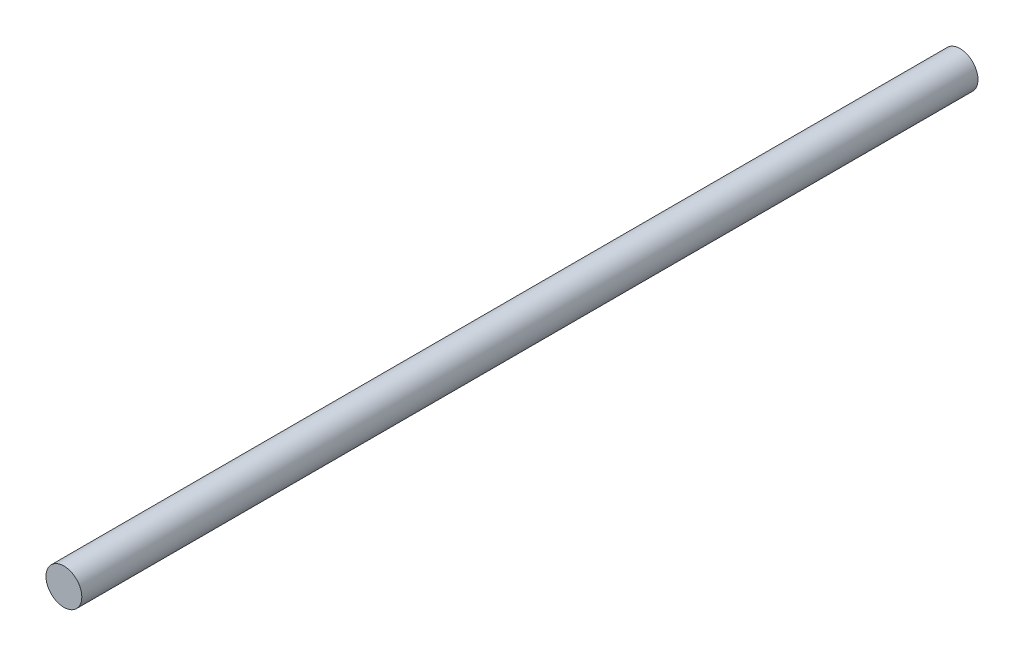
ISO-10303-21;
HEADER;
FILE_DESCRIPTION(('STEP AP214'),'2;1');
FILE_NAME('part.step','',(''),(''),'','','');
FILE_SCHEMA(('AUTOMOTIVE_DESIGN { 1 0 10303 214 1 1 1 1 }'));
ENDSEC;
DATA;
#1=APPLICATION_CONTEXT('core data for automotive mechanical design processes');
#2=APPLICATION_PROTOCOL_DEFINITION('international standard','automotive_design',2000,#1);
#3=PRODUCT_CONTEXT('',#1,'mechanical');
#4=PRODUCT('Part','Part','',(#3));
#5=PRODUCT_RELATED_PRODUCT_CATEGORY('part','',(#4));
#6=PRODUCT_DEFINITION_FORMATION('','',#4);
#7=PRODUCT_DEFINITION_CONTEXT('part definition',#1,'design');
#8=PRODUCT_DEFINITION('design','',#6,#7);
#9=PRODUCT_DEFINITION_SHAPE('','',#8);
#10=(LENGTH_UNIT() NAMED_UNIT(*) SI_UNIT(.MILLI.,.METRE.));
#11=(NAMED_UNIT(*) PLANE_ANGLE_UNIT() SI_UNIT($,.RADIAN.));
#12=(NAMED_UNIT(*) SI_UNIT($,.STERADIAN.) SOLID_ANGLE_UNIT());
#13=UNCERTAINTY_MEASURE_WITH_UNIT(LENGTH_MEASURE(1.E-05),#10,'distance_accuracy_value','');
#14=(GEOMETRIC_REPRESENTATION_CONTEXT(3) GLOBAL_UNCERTAINTY_ASSIGNED_CONTEXT((#13)) GLOBAL_UNIT_ASSIGNED_CONTEXT((#10,
#11,#12)) REPRESENTATION_CONTEXT('',''));
#15=CARTESIAN_POINT('',(0.,0.,0.));
#16=DIRECTION('',(0.,0.,1.));
#17=DIRECTION('',(1.,0.,0.));
#18=AXIS2_PLACEMENT_3D('',#15,#16,#17);
#19=CARTESIAN_POINT('',(0.,0.,500.));
#20=DIRECTION('',(0.,0.,-1.));
#21=DIRECTION('',(-1.,0.,0.));
#22=AXIS2_PLACEMENT_3D('',#19,#20,#21);
#23=CYLINDRICAL_SURFACE('',#22,10.);
#24=CARTESIAN_POINT('',(0.,0.,500.));
#25=DIRECTION('',(0.,0.,1.));
#26=DIRECTION('',(1.,0.,0.));
#27=AXIS2_PLACEMENT_3D('',#24,#25,#26);
#28=CIRCLE('',#27,10.);
#29=CARTESIAN_POINT('',(10.,0.,500.));
#30=VERTEX_POINT('',#29);
#31=EDGE_CURVE('E10',#30,#30,#28,.T.);
#32=ORIENTED_EDGE('',*,*,#31,.F.);
#33=EDGE_LOOP('',(#32));
#34=FACE_BOUND('',#33,.T.);
#35=CARTESIAN_POINT('',(0.,0.,0.));
#36=DIRECTION('',(0.,0.,1.));
#37=DIRECTION('',(1.,0.,0.));
#38=AXIS2_PLACEMENT_3D('',#35,#36,#37);
#39=CIRCLE('',#38,10.);
#40=CARTESIAN_POINT('',(10.,0.,0.));
#41=VERTEX_POINT('',#40);
#42=EDGE_CURVE('E40',#41,#41,#39,.T.);
#43=ORIENTED_EDGE('',*,*,#42,.T.);
#44=EDGE_LOOP('',(#43));
#45=FACE_BOUND('',#44,.T.);
#46=ADVANCED_FACE('F37',(#34,#45),#23,.T.);
#47=CARTESIAN_POINT('',(0.,0.,500.));
#48=DIRECTION('',(0.,0.,1.));
#49=DIRECTION('',(1.,0.,0.));
#50=AXIS2_PLACEMENT_3D('',#47,#48,#49);
#51=PLANE('',#50);
#52=ORIENTED_EDGE('',*,*,#31,.T.);
#53=EDGE_LOOP('',(#52));
#54=FACE_BOUND('',#53,.T.);
#55=ADVANCED_FACE('F52',(#54),#51,.T.);
#56=CARTESIAN_POINT('',(0.,0.,0.));
#57=DIRECTION('',(0.,0.,1.));
#58=DIRECTION('',(1.,0.,0.));
#59=AXIS2_PLACEMENT_3D('',#56,#57,#58);
#60=PLANE('',#59);
#61=ORIENTED_EDGE('',*,*,#42,.F.);
#62=EDGE_LOOP('',(#61));
#63=FACE_BOUND('',#62,.T.);
#64=ADVANCED_FACE('F50',(#63),#60,.F.);
#65=CLOSED_SHELL('',(#46,#55,#64));
#66=MANIFOLD_SOLID_BREP('B2',#65);
#67=ADVANCED_BREP_SHAPE_REPRESENTATION('',(#18,#66),#14);
#68=SHAPE_DEFINITION_REPRESENTATION(#9,#67);
ENDSEC;
END-ISO-10303-21;
